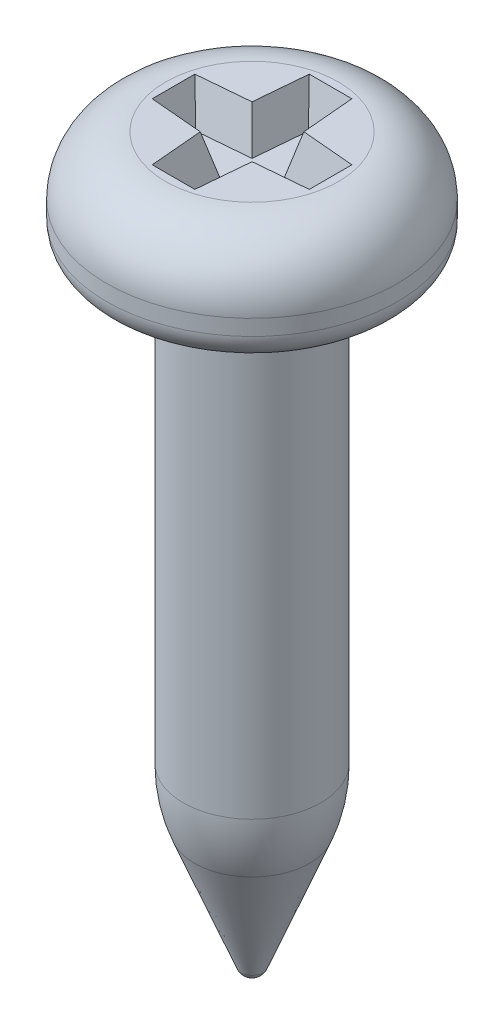
ISO-10303-21;
HEADER;
FILE_DESCRIPTION(('STEP AP214'),'2;1');
FILE_NAME('part.step','',(''),(''),'','','');
FILE_SCHEMA(('AUTOMOTIVE_DESIGN { 1 0 10303 214 1 1 1 1 }'));
ENDSEC;
DATA;
#1=APPLICATION_CONTEXT('core data for automotive mechanical design processes');
#2=APPLICATION_PROTOCOL_DEFINITION('international standard','automotive_design',2000,#1);
#3=PRODUCT_CONTEXT('',#1,'mechanical');
#4=PRODUCT('Part','Part','',(#3));
#5=PRODUCT_RELATED_PRODUCT_CATEGORY('part','',(#4));
#6=PRODUCT_DEFINITION_FORMATION('','',#4);
#7=PRODUCT_DEFINITION_CONTEXT('part definition',#1,'design');
#8=PRODUCT_DEFINITION('design','',#6,#7);
#9=PRODUCT_DEFINITION_SHAPE('','',#8);
#10=(LENGTH_UNIT() NAMED_UNIT(*) SI_UNIT(.MILLI.,.METRE.));
#11=(NAMED_UNIT(*) PLANE_ANGLE_UNIT() SI_UNIT($,.RADIAN.));
#12=(NAMED_UNIT(*) SI_UNIT($,.STERADIAN.) SOLID_ANGLE_UNIT());
#13=UNCERTAINTY_MEASURE_WITH_UNIT(LENGTH_MEASURE(1.E-05),#10,'distance_accuracy_value','');
#14=(GEOMETRIC_REPRESENTATION_CONTEXT(3) GLOBAL_UNCERTAINTY_ASSIGNED_CONTEXT((#13)) GLOBAL_UNIT_ASSIGNED_CONTEXT((#10,
#11,#12)) REPRESENTATION_CONTEXT('',''));
#15=CARTESIAN_POINT('',(0.,0.,0.));
#16=DIRECTION('',(0.,0.,1.));
#17=DIRECTION('',(1.,0.,0.));
#18=AXIS2_PLACEMENT_3D('',#15,#16,#17);
#19=CARTESIAN_POINT('',(1.1,0.,0.));
#20=DIRECTION('',(0.,-1.,0.));
#21=DIRECTION('',(1.,0.,0.));
#22=AXIS2_PLACEMENT_3D('',#19,#20,#21);
#23=PLANE('',#22);
#24=DIRECTION('',(-1.,0.,0.));
#25=VECTOR('',#24,1.);
#26=CARTESIAN_POINT('',(-0.271382595437633,0.,-1.));
#27=LINE('',#26,#25);
#28=CARTESIAN_POINT('',(0.271382595437633,0.,-1.));
#29=VERTEX_POINT('',#28);
#30=CARTESIAN_POINT('',(-0.271382595437633,0.,-1.));
#31=VERTEX_POINT('',#30);
#32=EDGE_CURVE('E140',#29,#31,#27,.T.);
#33=ORIENTED_EDGE('',*,*,#32,.F.);
#34=DIRECTION('',(-0.0871557427476548,0.,-0.996194698091746));
#35=VECTOR('',#34,1.);
#36=CARTESIAN_POINT('',(0.271382595437633,0.,-1.));
#37=LINE('',#36,#35);
#38=CARTESIAN_POINT('',(0.33,0.,-0.33));
#39=VERTEX_POINT('',#38);
#40=EDGE_CURVE('E48',#39,#29,#37,.T.);
#41=ORIENTED_EDGE('',*,*,#40,.F.);
#42=DIRECTION('',(-0.996194698091746,0.,-0.0871557427476548));
#43=VECTOR('',#42,1.);
#44=CARTESIAN_POINT('',(0.33,0.,-0.33));
#45=LINE('',#44,#43);
#46=CARTESIAN_POINT('',(1.,0.,-0.271382595437633));
#47=VERTEX_POINT('',#46);
#48=EDGE_CURVE('E172',#47,#39,#45,.T.);
#49=ORIENTED_EDGE('',*,*,#48,.F.);
#50=DIRECTION('',(0.,0.,-1.));
#51=VECTOR('',#50,1.);
#52=CARTESIAN_POINT('',(1.,0.,-0.271382595437633));
#53=LINE('',#52,#51);
#54=CARTESIAN_POINT('',(1.,0.,0.271382595437633));
#55=VERTEX_POINT('',#54);
#56=EDGE_CURVE('E170',#55,#47,#53,.T.);
#57=ORIENTED_EDGE('',*,*,#56,.F.);
#58=DIRECTION('',(0.996194698091746,0.,-0.0871557427476548));
#59=VECTOR('',#58,1.);
#60=CARTESIAN_POINT('',(0.33,0.,0.33));
#61=LINE('',#60,#59);
#62=CARTESIAN_POINT('',(0.33,0.,0.33));
#63=VERTEX_POINT('',#62);
#64=EDGE_CURVE('E167',#63,#55,#61,.T.);
#65=ORIENTED_EDGE('',*,*,#64,.F.);
#66=DIRECTION('',(0.0871557427476548,0.,-0.996194698091746));
#67=VECTOR('',#66,1.);
#68=CARTESIAN_POINT('',(0.271382595437633,0.,1.));
#69=LINE('',#68,#67);
#70=CARTESIAN_POINT('',(0.271382595437633,0.,1.));
#71=VERTEX_POINT('',#70);
#72=EDGE_CURVE('E164',#71,#63,#69,.T.);
#73=ORIENTED_EDGE('',*,*,#72,.F.);
#74=DIRECTION('',(1.,0.,0.));
#75=VECTOR('',#74,1.);
#76=CARTESIAN_POINT('',(-0.271382595437633,0.,1.));
#77=LINE('',#76,#75);
#78=CARTESIAN_POINT('',(-0.271382595437633,0.,1.));
#79=VERTEX_POINT('',#78);
#80=EDGE_CURVE('E161',#79,#71,#77,.T.);
#81=ORIENTED_EDGE('',*,*,#80,.F.);
#82=DIRECTION('',(0.0871557427476548,0.,0.996194698091746));
#83=VECTOR('',#82,1.);
#84=CARTESIAN_POINT('',(-0.271382595437633,0.,1.));
#85=LINE('',#84,#83);
#86=CARTESIAN_POINT('',(-0.33,0.,0.33));
#87=VERTEX_POINT('',#86);
#88=EDGE_CURVE('E158',#87,#79,#85,.T.);
#89=ORIENTED_EDGE('',*,*,#88,.F.);
#90=DIRECTION('',(0.996194698091746,0.,0.0871557427476548));
#91=VECTOR('',#90,1.);
#92=CARTESIAN_POINT('',(-0.33,0.,0.33));
#93=LINE('',#92,#91);
#94=CARTESIAN_POINT('',(-1.,0.,0.271382595437633));
#95=VERTEX_POINT('',#94);
#96=EDGE_CURVE('E155',#95,#87,#93,.T.);
#97=ORIENTED_EDGE('',*,*,#96,.F.);
#98=DIRECTION('',(0.,0.,1.));
#99=VECTOR('',#98,1.);
#100=CARTESIAN_POINT('',(-1.,0.,-0.271382595437633));
#101=LINE('',#100,#99);
#102=CARTESIAN_POINT('',(-1.,0.,-0.271382595437633));
#103=VERTEX_POINT('',#102);
#104=EDGE_CURVE('E149',#103,#95,#101,.T.);
#105=ORIENTED_EDGE('',*,*,#104,.F.);
#106=DIRECTION('',(-0.996194698091746,0.,0.0871557427476548));
#107=VECTOR('',#106,1.);
#108=CARTESIAN_POINT('',(-0.33,0.,-0.33));
#109=LINE('',#108,#107);
#110=CARTESIAN_POINT('',(-0.33,0.,-0.33));
#111=VERTEX_POINT('',#110);
#112=EDGE_CURVE('E147',#111,#103,#109,.T.);
#113=ORIENTED_EDGE('',*,*,#112,.F.);
#114=DIRECTION('',(-0.0871557427476548,0.,0.996194698091746));
#115=VECTOR('',#114,1.);
#116=CARTESIAN_POINT('',(-0.271382595437633,0.,-1.));
#117=LINE('',#116,#115);
#118=EDGE_CURVE('E131',#31,#111,#117,.T.);
#119=ORIENTED_EDGE('',*,*,#118,.F.);
#120=EDGE_LOOP('',(#33,#41,#49,#57,#65,#73,#81,#89,#97,#105,#113,#119));
#121=FACE_BOUND('',#120,.T.);
#122=CARTESIAN_POINT('',(0.,0.,0.));
#123=DIRECTION('',(0.,1.,0.));
#124=DIRECTION('',(-1.,0.,0.));
#125=AXIS2_PLACEMENT_3D('',#122,#123,#124);
#126=CIRCLE('',#125,1.1);
#127=CARTESIAN_POINT('',(-1.1,0.,0.));
#128=VERTEX_POINT('',#127);
#129=EDGE_CURVE('E11',#128,#128,#126,.T.);
#130=ORIENTED_EDGE('',*,*,#129,.T.);
#131=EDGE_LOOP('',(#130));
#132=FACE_BOUND('',#131,.T.);
#133=ADVANCED_FACE('F34',(#121,#132),#23,.F.);
#134=CARTESIAN_POINT('',(0.,-0.75,0.));
#135=DIRECTION('',(0.,1.,0.));
#136=DIRECTION('',(-1.,0.,0.));
#137=AXIS2_PLACEMENT_3D('',#134,#135,#136);
#138=TOROIDAL_SURFACE('',#137,1.1,0.75);
#139=ORIENTED_EDGE('',*,*,#129,.F.);
#140=EDGE_LOOP('',(#139));
#141=FACE_BOUND('',#140,.T.);
#142=CARTESIAN_POINT('',(0.,-0.75,0.));
#143=DIRECTION('',(0.,1.,0.));
#144=DIRECTION('',(-1.,0.,0.));
#145=AXIS2_PLACEMENT_3D('',#142,#143,#144);
#146=CIRCLE('',#145,1.85);
#147=CARTESIAN_POINT('',(-1.85,-0.75,0.));
#148=VERTEX_POINT('',#147);
#149=EDGE_CURVE('E41',#148,#148,#146,.T.);
#150=ORIENTED_EDGE('',*,*,#149,.T.);
#151=EDGE_LOOP('',(#150));
#152=FACE_BOUND('',#151,.T.);
#153=ADVANCED_FACE('F248',(#141,#152),#138,.T.);
#154=CARTESIAN_POINT('',(0.,0.,0.));
#155=DIRECTION('',(0.,1.,0.));
#156=DIRECTION('',(-1.,0.,0.));
#157=AXIS2_PLACEMENT_3D('',#154,#155,#156);
#158=CYLINDRICAL_SURFACE('',#157,1.85);
#159=ORIENTED_EDGE('',*,*,#149,.F.);
#160=EDGE_LOOP('',(#159));
#161=FACE_BOUND('',#160,.T.);
#162=CARTESIAN_POINT('',(0.,-0.95,0.));
#163=DIRECTION('',(0.,1.,0.));
#164=DIRECTION('',(-1.,0.,0.));
#165=AXIS2_PLACEMENT_3D('',#162,#163,#164);
#166=CIRCLE('',#165,1.85);
#167=CARTESIAN_POINT('',(-1.85,-0.95,0.));
#168=VERTEX_POINT('',#167);
#169=EDGE_CURVE('E243',#168,#168,#166,.T.);
#170=ORIENTED_EDGE('',*,*,#169,.T.);
#171=EDGE_LOOP('',(#170));
#172=FACE_BOUND('',#171,.T.);
#173=ADVANCED_FACE('F250',(#161,#172),#158,.T.);
#174=CARTESIAN_POINT('',(0.,-0.95,0.));
#175=DIRECTION('',(0.,1.,0.));
#176=DIRECTION('',(-1.,0.,0.));
#177=AXIS2_PLACEMENT_3D('',#174,#175,#176);
#178=TOROIDAL_SURFACE('',#177,1.5,0.35);
#179=ORIENTED_EDGE('',*,*,#169,.F.);
#180=EDGE_LOOP('',(#179));
#181=FACE_BOUND('',#180,.T.);
#182=CARTESIAN_POINT('',(0.,-1.3,0.));
#183=DIRECTION('',(0.,1.,0.));
#184=DIRECTION('',(-1.,0.,0.));
#185=AXIS2_PLACEMENT_3D('',#182,#183,#184);
#186=CIRCLE('',#185,1.5);
#187=CARTESIAN_POINT('',(-1.5,-1.3,0.));
#188=VERTEX_POINT('',#187);
#189=EDGE_CURVE('E240',#188,#188,#186,.T.);
#190=ORIENTED_EDGE('',*,*,#189,.T.);
#191=EDGE_LOOP('',(#190));
#192=FACE_BOUND('',#191,.T.);
#193=ADVANCED_FACE('F253',(#181,#192),#178,.T.);
#194=CARTESIAN_POINT('',(1.025,-1.3,0.));
#195=DIRECTION('',(0.,1.,0.));
#196=DIRECTION('',(-1.,0.,0.));
#197=AXIS2_PLACEMENT_3D('',#194,#195,#196);
#198=PLANE('',#197);
#199=ORIENTED_EDGE('',*,*,#189,.F.);
#200=EDGE_LOOP('',(#199));
#201=FACE_BOUND('',#200,.T.);
#202=CARTESIAN_POINT('',(0.,-1.3,0.));
#203=DIRECTION('',(0.,1.,0.));
#204=DIRECTION('',(-1.,0.,0.));
#205=AXIS2_PLACEMENT_3D('',#202,#203,#204);
#206=CIRCLE('',#205,1.025);
#207=CARTESIAN_POINT('',(-1.025,-1.3,0.));
#208=VERTEX_POINT('',#207);
#209=EDGE_CURVE('E237',#208,#208,#206,.T.);
#210=ORIENTED_EDGE('',*,*,#209,.T.);
#211=EDGE_LOOP('',(#210));
#212=FACE_BOUND('',#211,.T.);
#213=ADVANCED_FACE('F259',(#201,#212),#198,.F.);
#214=CARTESIAN_POINT('',(0.,-1.45,0.));
#215=DIRECTION('',(0.,1.,0.));
#216=DIRECTION('',(-1.,0.,0.));
#217=AXIS2_PLACEMENT_3D('',#214,#215,#216);
#218=TOROIDAL_SURFACE('',#217,1.025,0.15);
#219=ORIENTED_EDGE('',*,*,#209,.F.);
#220=EDGE_LOOP('',(#219));
#221=FACE_BOUND('',#220,.T.);
#222=CARTESIAN_POINT('',(0.,-1.45,0.));
#223=DIRECTION('',(0.,1.,0.));
#224=DIRECTION('',(-1.,0.,0.));
#225=AXIS2_PLACEMENT_3D('',#222,#223,#224);
#226=CIRCLE('',#225,0.874999999999999);
#227=CARTESIAN_POINT('',(-0.874999999999999,-1.45,0.));
#228=VERTEX_POINT('',#227);
#229=EDGE_CURVE('E234',#228,#228,#226,.T.);
#230=ORIENTED_EDGE('',*,*,#229,.T.);
#231=EDGE_LOOP('',(#230));
#232=FACE_BOUND('',#231,.T.);
#233=ADVANCED_FACE('F265',(#221,#232),#218,.F.);
#234=CARTESIAN_POINT('',(0.,0.,0.));
#235=DIRECTION('',(0.,1.,0.));
#236=DIRECTION('',(-1.,0.,0.));
#237=AXIS2_PLACEMENT_3D('',#234,#235,#236);
#238=CYLINDRICAL_SURFACE('',#237,0.875);
#239=ORIENTED_EDGE('',*,*,#229,.F.);
#240=EDGE_LOOP('',(#239));
#241=FACE_BOUND('',#240,.T.);
#242=CARTESIAN_POINT('',(0.,-6.96440542344636,0.));
#243=DIRECTION('',(0.,1.,0.));
#244=DIRECTION('',(-1.,0.,0.));
#245=AXIS2_PLACEMENT_3D('',#242,#243,#244);
#246=CIRCLE('',#245,0.875);
#247=CARTESIAN_POINT('',(-0.874999999999999,-6.96440542344636,0.));
#248=VERTEX_POINT('',#247);
#249=EDGE_CURVE('E231',#248,#248,#246,.T.);
#250=ORIENTED_EDGE('',*,*,#249,.T.);
#251=EDGE_LOOP('',(#250));
#252=FACE_BOUND('',#251,.T.);
#253=ADVANCED_FACE('F271',(#241,#252),#238,.T.);
#254=CARTESIAN_POINT('',(0.,-6.96440542344636,0.));
#255=DIRECTION('',(0.,1.,0.));
#256=DIRECTION('',(-1.,0.,0.));
#257=AXIS2_PLACEMENT_3D('',#254,#255,#256);
#258=DEGENERATE_TOROIDAL_SURFACE('',#257,1.125,2.,.F.);
#259=ORIENTED_EDGE('',*,*,#249,.F.);
#260=EDGE_LOOP('',(#259));
#261=FACE_BOUND('',#260,.T.);
#262=CARTESIAN_POINT('',(0.,-7.7,0.));
#263=DIRECTION('',(0.,1.,0.));
#264=DIRECTION('',(-1.,0.,0.));
#265=AXIS2_PLACEMENT_3D('',#262,#263,#264);
#266=CIRCLE('',#265,0.73481198483741);
#267=CARTESIAN_POINT('',(-0.734811984837409,-7.7,0.));
#268=VERTEX_POINT('',#267);
#269=EDGE_CURVE('E228',#268,#268,#266,.T.);
#270=ORIENTED_EDGE('',*,*,#269,.T.);
#271=EDGE_LOOP('',(#270));
#272=FACE_BOUND('',#271,.T.);
#273=ADVANCED_FACE('F277',(#261,#272),#258,.F.);
#274=CARTESIAN_POINT('',(0.,-9.20516959324152,0.));
#275=DIRECTION('',(0.,1.,0.));
#276=DIRECTION('',(-1.,0.,0.));
#277=AXIS2_PLACEMENT_3D('',#274,#275,#276);
#278=CONICAL_SURFACE('',#277,0.139485898862806,0.376639161138822);
#279=ORIENTED_EDGE('',*,*,#269,.F.);
#280=EDGE_LOOP('',(#279));
#281=FACE_BOUND('',#280,.T.);
#282=CARTESIAN_POINT('',(0.,-9.20516959324152,0.));
#283=DIRECTION('',(0.,1.,0.));
#284=DIRECTION('',(-1.,0.,0.));
#285=AXIS2_PLACEMENT_3D('',#282,#283,#284);
#286=CIRCLE('',#285,0.139485898862806);
#287=CARTESIAN_POINT('',(-0.139485898862805,-9.20516959324152,0.));
#288=VERTEX_POINT('',#287);
#289=EDGE_CURVE('E176',#288,#288,#286,.T.);
#290=ORIENTED_EDGE('',*,*,#289,.T.);
#291=EDGE_LOOP('',(#290));
#292=FACE_BOUND('',#291,.T.);
#293=ADVANCED_FACE('F283',(#281,#292),#278,.T.);
#294=CARTESIAN_POINT('',(0.,-9.15,0.));
#295=DIRECTION('',(0.,1.,0.));
#296=DIRECTION('',(-1.,0.,0.));
#297=AXIS2_PLACEMENT_3D('',#294,#295,#296);
#298=SPHERICAL_SURFACE('',#297,0.149999999999999);
#299=ORIENTED_EDGE('',*,*,#289,.F.);
#300=EDGE_LOOP('',(#299));
#301=FACE_BOUND('',#300,.T.);
#302=ADVANCED_FACE('F289',(#301),#298,.T.);
#303=CARTESIAN_POINT('',(0.271382595437633,0.,-1.));
#304=DIRECTION('',(0.962250186899058,-0.258819045102521,-0.0841859828293659));
#305=DIRECTION('',(0.259741110692871,0.965678287741851,0.));
#306=AXIS2_PLACEMENT_3D('',#303,#304,#305);
#307=PLANE('',#306);
#308=ORIENTED_EDGE('',*,*,#40,.T.);
#309=DIRECTION('',(0.230762906723662,0.939855498552101,-0.251833521838986));
#310=VECTOR('',#309,1.);
#311=CARTESIAN_POINT('',(0.271382595437633,0.,-1.));
#312=LINE('',#311,#310);
#313=CARTESIAN_POINT('',(0.148617496398917,-0.5,-0.866025403784438));
#314=VERTEX_POINT('',#313);
#315=EDGE_CURVE('E91',#314,#29,#312,.T.);
#316=ORIENTED_EDGE('',*,*,#315,.F.);
#317=DIRECTION('',(-0.0871557427476548,0.,-0.996194698091746));
#318=VECTOR('',#317,1.);
#319=CARTESIAN_POINT('',(0.222680446133132,-0.5,-0.0194820146255435));
#320=LINE('',#319,#318);
#321=CARTESIAN_POINT('',(0.206333094846248,-0.5,-0.206333094846248));
#322=VERTEX_POINT('',#321);
#323=EDGE_CURVE('E174',#322,#314,#320,.T.);
#324=ORIENTED_EDGE('',*,*,#323,.F.);
#325=DIRECTION('',(0.233463888260859,0.943922256203466,-0.233463888260859));
#326=VECTOR('',#325,1.);
#327=CARTESIAN_POINT('',(0.363323645043907,0.134731458681192,-0.363323645043907));
#328=LINE('',#327,#326);
#329=EDGE_CURVE('E56',#322,#39,#328,.T.);
#330=ORIENTED_EDGE('',*,*,#329,.T.);
#331=EDGE_LOOP('',(#308,#316,#324,#330));
#332=FACE_BOUND('',#331,.T.);
#333=ADVANCED_FACE('F294',(#332),#307,.F.);
#334=CARTESIAN_POINT('',(0.33,0.,-0.33));
#335=DIRECTION('',(0.0841859828293659,-0.258819045102521,-0.962250186899058));
#336=DIRECTION('',(0.,0.965678287741851,-0.259741110692871));
#337=AXIS2_PLACEMENT_3D('',#334,#335,#336);
#338=PLANE('',#337);
#339=ORIENTED_EDGE('',*,*,#48,.T.);
#340=ORIENTED_EDGE('',*,*,#329,.F.);
#341=DIRECTION('',(-0.996194698091746,0.,-0.0871557427476548));
#342=VECTOR('',#341,1.);
#343=CARTESIAN_POINT('',(0.0194820146255435,-0.5,-0.222680446133132));
#344=LINE('',#343,#342);
#345=CARTESIAN_POINT('',(0.866025403784438,-0.5,-0.148617496398917));
#346=VERTEX_POINT('',#345);
#347=EDGE_CURVE('E177',#346,#322,#344,.T.);
#348=ORIENTED_EDGE('',*,*,#347,.F.);
#349=DIRECTION('',(0.251833521838986,0.939855498552101,-0.230762906723662));
#350=VECTOR('',#349,1.);
#351=CARTESIAN_POINT('',(1.,0.,-0.271382595437633));
#352=LINE('',#351,#350);
#353=EDGE_CURVE('E96',#346,#47,#352,.T.);
#354=ORIENTED_EDGE('',*,*,#353,.T.);
#355=EDGE_LOOP('',(#339,#340,#348,#354));
#356=FACE_BOUND('',#355,.T.);
#357=ADVANCED_FACE('F299',(#356),#338,.F.);
#358=CARTESIAN_POINT('',(1.,0.,-0.271382595437633));
#359=DIRECTION('',(0.965925826289068,-0.258819045102521,0.));
#360=DIRECTION('',(0.258819045102521,0.965925826289068,0.));
#361=AXIS2_PLACEMENT_3D('',#358,#359,#360);
#362=PLANE('',#361);
#363=ORIENTED_EDGE('',*,*,#56,.T.);
#364=ORIENTED_EDGE('',*,*,#353,.F.);
#365=DIRECTION('',(0.,0.,-1.));
#366=VECTOR('',#365,1.);
#367=CARTESIAN_POINT('',(0.866025403784438,-0.5,0.));
#368=LINE('',#367,#366);
#369=CARTESIAN_POINT('',(0.866025403784438,-0.5,0.148617496398917));
#370=VERTEX_POINT('',#369);
#371=EDGE_CURVE('E200',#370,#346,#368,.T.);
#372=ORIENTED_EDGE('',*,*,#371,.F.);
#373=DIRECTION('',(0.251833521838986,0.939855498552101,0.230762906723662));
#374=VECTOR('',#373,1.);
#375=CARTESIAN_POINT('',(0.960914999983138,-0.145867205876761,0.23556779148571));
#376=LINE('',#375,#374);
#377=EDGE_CURVE('E192',#370,#55,#376,.T.);
#378=ORIENTED_EDGE('',*,*,#377,.T.);
#379=EDGE_LOOP('',(#363,#364,#372,#378));
#380=FACE_BOUND('',#379,.T.);
#381=ADVANCED_FACE('F361',(#380),#362,.F.);
#382=CARTESIAN_POINT('',(0.33,0.,0.33));
#383=DIRECTION('',(0.0841859828293659,-0.258819045102521,0.962250186899058));
#384=DIRECTION('',(0.,-0.965678287741851,-0.259741110692871));
#385=AXIS2_PLACEMENT_3D('',#382,#383,#384);
#386=PLANE('',#385);
#387=ORIENTED_EDGE('',*,*,#64,.T.);
#388=ORIENTED_EDGE('',*,*,#377,.F.);
#389=DIRECTION('',(0.996194698091746,0.,-0.0871557427476548));
#390=VECTOR('',#389,1.);
#391=CARTESIAN_POINT('',(0.0194820146255435,-0.5,0.222680446133132));
#392=LINE('',#391,#390);
#393=CARTESIAN_POINT('',(0.206333094846248,-0.5,0.206333094846248));
#394=VERTEX_POINT('',#393);
#395=EDGE_CURVE('E203',#394,#370,#392,.T.);
#396=ORIENTED_EDGE('',*,*,#395,.F.);
#397=DIRECTION('',(0.233463888260859,0.943922256203466,0.233463888260859));
#398=VECTOR('',#397,1.);
#399=CARTESIAN_POINT('',(0.33,0.,0.33));
#400=LINE('',#399,#398);
#401=EDGE_CURVE('E190',#394,#63,#400,.T.);
#402=ORIENTED_EDGE('',*,*,#401,.T.);
#403=EDGE_LOOP('',(#387,#388,#396,#402));
#404=FACE_BOUND('',#403,.T.);
#405=ADVANCED_FACE('F369',(#404),#386,.F.);
#406=CARTESIAN_POINT('',(0.271382595437633,0.,1.));
#407=DIRECTION('',(0.962250186899058,-0.258819045102521,0.0841859828293659));
#408=DIRECTION('',(0.259741110692871,0.965678287741851,0.));
#409=AXIS2_PLACEMENT_3D('',#406,#407,#408);
#410=PLANE('',#409);
#411=ORIENTED_EDGE('',*,*,#72,.T.);
#412=ORIENTED_EDGE('',*,*,#401,.F.);
#413=DIRECTION('',(0.0871557427476548,0.,-0.996194698091746));
#414=VECTOR('',#413,1.);
#415=CARTESIAN_POINT('',(0.222680446133132,-0.5,0.0194820146255435));
#416=LINE('',#415,#414);
#417=CARTESIAN_POINT('',(0.148617496398917,-0.5,0.866025403784438));
#418=VERTEX_POINT('',#417);
#419=EDGE_CURVE('E206',#418,#394,#416,.T.);
#420=ORIENTED_EDGE('',*,*,#419,.F.);
#421=DIRECTION('',(0.230762906723662,0.939855498552101,0.251833521838986));
#422=VECTOR('',#421,1.);
#423=CARTESIAN_POINT('',(0.242479524498311,-0.117716969910997,0.968457832976909));
#424=LINE('',#423,#422);
#425=EDGE_CURVE('E188',#418,#71,#424,.T.);
#426=ORIENTED_EDGE('',*,*,#425,.T.);
#427=EDGE_LOOP('',(#411,#412,#420,#426));
#428=FACE_BOUND('',#427,.T.);
#429=ADVANCED_FACE('F379',(#428),#410,.F.);
#430=CARTESIAN_POINT('',(-0.271382595437633,0.,1.));
#431=DIRECTION('',(0.,-0.258819045102521,0.965925826289068));
#432=DIRECTION('',(0.,-0.965925826289068,-0.258819045102521));
#433=AXIS2_PLACEMENT_3D('',#430,#431,#432);
#434=PLANE('',#433);
#435=ORIENTED_EDGE('',*,*,#80,.T.);
#436=ORIENTED_EDGE('',*,*,#425,.F.);
#437=DIRECTION('',(1.,0.,0.));
#438=VECTOR('',#437,1.);
#439=CARTESIAN_POINT('',(0.,-0.5,0.866025403784438));
#440=LINE('',#439,#438);
#441=CARTESIAN_POINT('',(-0.148617496398917,-0.5,0.866025403784438));
#442=VERTEX_POINT('',#441);
#443=EDGE_CURVE('E209',#442,#418,#440,.T.);
#444=ORIENTED_EDGE('',*,*,#443,.F.);
#445=DIRECTION('',(-0.230762906723662,0.939855498552101,0.251833521838986));
#446=VECTOR('',#445,1.);
#447=CARTESIAN_POINT('',(-0.271382595437633,0.,1.));
#448=LINE('',#447,#446);
#449=EDGE_CURVE('E186',#442,#79,#448,.T.);
#450=ORIENTED_EDGE('',*,*,#449,.T.);
#451=EDGE_LOOP('',(#435,#436,#444,#450));
#452=FACE_BOUND('',#451,.T.);
#453=ADVANCED_FACE('F389',(#452),#434,.F.);
#454=CARTESIAN_POINT('',(-0.271382595437633,0.,1.));
#455=DIRECTION('',(-0.962250186899058,-0.258819045102521,0.0841859828293659));
#456=DIRECTION('',(0.259741110692871,-0.965678287741851,0.));
#457=AXIS2_PLACEMENT_3D('',#454,#455,#456);
#458=PLANE('',#457);
#459=ORIENTED_EDGE('',*,*,#88,.T.);
#460=ORIENTED_EDGE('',*,*,#449,.F.);
#461=DIRECTION('',(0.0871557427476548,0.,0.996194698091746));
#462=VECTOR('',#461,1.);
#463=CARTESIAN_POINT('',(-0.222680446133132,-0.5,0.0194820146255435));
#464=LINE('',#463,#462);
#465=CARTESIAN_POINT('',(-0.206333094846248,-0.5,0.206333094846248));
#466=VERTEX_POINT('',#465);
#467=EDGE_CURVE('E212',#466,#442,#464,.T.);
#468=ORIENTED_EDGE('',*,*,#467,.F.);
#469=DIRECTION('',(-0.23346388826086,0.943922256203466,0.233463888260859));
#470=VECTOR('',#469,1.);
#471=CARTESIAN_POINT('',(-0.363323645043907,0.134731458681192,0.363323645043907));
#472=LINE('',#471,#470);
#473=EDGE_CURVE('E184',#466,#87,#472,.T.);
#474=ORIENTED_EDGE('',*,*,#473,.T.);
#475=EDGE_LOOP('',(#459,#460,#468,#474));
#476=FACE_BOUND('',#475,.T.);
#477=ADVANCED_FACE('F399',(#476),#458,.F.);
#478=CARTESIAN_POINT('',(-0.33,0.,0.33));
#479=DIRECTION('',(-0.0841859828293659,-0.258819045102521,0.962250186899058));
#480=DIRECTION('',(0.,-0.965678287741851,-0.259741110692871));
#481=AXIS2_PLACEMENT_3D('',#478,#479,#480);
#482=PLANE('',#481);
#483=ORIENTED_EDGE('',*,*,#96,.T.);
#484=ORIENTED_EDGE('',*,*,#473,.F.);
#485=DIRECTION('',(0.996194698091746,0.,0.0871557427476548));
#486=VECTOR('',#485,1.);
#487=CARTESIAN_POINT('',(-0.0194820146255434,-0.5,0.222680446133132));
#488=LINE('',#487,#486);
#489=CARTESIAN_POINT('',(-0.866025403784438,-0.5,0.148617496398917));
#490=VERTEX_POINT('',#489);
#491=EDGE_CURVE('E215',#490,#466,#488,.T.);
#492=ORIENTED_EDGE('',*,*,#491,.F.);
#493=DIRECTION('',(-0.251833521838987,0.939855498552101,0.230762906723662));
#494=VECTOR('',#493,1.);
#495=CARTESIAN_POINT('',(-0.968457832976909,-0.117716969910997,0.242479524498311));
#496=LINE('',#495,#494);
#497=EDGE_CURVE('E182',#490,#95,#496,.T.);
#498=ORIENTED_EDGE('',*,*,#497,.T.);
#499=EDGE_LOOP('',(#483,#484,#492,#498));
#500=FACE_BOUND('',#499,.T.);
#501=ADVANCED_FACE('F409',(#500),#482,.F.);
#502=CARTESIAN_POINT('',(-1.,0.,-0.271382595437633));
#503=DIRECTION('',(-0.965925826289068,-0.258819045102521,0.));
#504=DIRECTION('',(0.258819045102522,-0.965925826289068,0.));
#505=AXIS2_PLACEMENT_3D('',#502,#503,#504);
#506=PLANE('',#505);
#507=ORIENTED_EDGE('',*,*,#104,.T.);
#508=ORIENTED_EDGE('',*,*,#497,.F.);
#509=DIRECTION('',(0.,0.,1.));
#510=VECTOR('',#509,1.);
#511=CARTESIAN_POINT('',(-0.866025403784438,-0.5,0.));
#512=LINE('',#511,#510);
#513=CARTESIAN_POINT('',(-0.866025403784438,-0.5,-0.148617496398917));
#514=VERTEX_POINT('',#513);
#515=EDGE_CURVE('E218',#514,#490,#512,.T.);
#516=ORIENTED_EDGE('',*,*,#515,.F.);
#517=DIRECTION('',(-0.251833521838987,0.939855498552101,-0.230762906723662));
#518=VECTOR('',#517,1.);
#519=CARTESIAN_POINT('',(-0.960914999983137,-0.145867205876761,-0.23556779148571));
#520=LINE('',#519,#518);
#521=EDGE_CURVE('E180',#514,#103,#520,.T.);
#522=ORIENTED_EDGE('',*,*,#521,.T.);
#523=EDGE_LOOP('',(#507,#508,#516,#522));
#524=FACE_BOUND('',#523,.T.);
#525=ADVANCED_FACE('F419',(#524),#506,.F.);
#526=CARTESIAN_POINT('',(-0.33,0.,-0.33));
#527=DIRECTION('',(-0.0841859828293659,-0.258819045102521,-0.962250186899058));
#528=DIRECTION('',(0.,0.965678287741851,-0.259741110692871));
#529=AXIS2_PLACEMENT_3D('',#526,#527,#528);
#530=PLANE('',#529);
#531=ORIENTED_EDGE('',*,*,#112,.T.);
#532=ORIENTED_EDGE('',*,*,#521,.F.);
#533=DIRECTION('',(-0.996194698091746,0.,0.0871557427476548));
#534=VECTOR('',#533,1.);
#535=CARTESIAN_POINT('',(-0.0194820146255434,-0.5,-0.222680446133132));
#536=LINE('',#535,#534);
#537=CARTESIAN_POINT('',(-0.206333094846248,-0.5,-0.206333094846248));
#538=VERTEX_POINT('',#537);
#539=EDGE_CURVE('E221',#538,#514,#536,.T.);
#540=ORIENTED_EDGE('',*,*,#539,.F.);
#541=DIRECTION('',(-0.23346388826086,0.943922256203466,-0.233463888260859));
#542=VECTOR('',#541,1.);
#543=CARTESIAN_POINT('',(-0.33,0.,-0.33));
#544=LINE('',#543,#542);
#545=EDGE_CURVE('E137',#538,#111,#544,.T.);
#546=ORIENTED_EDGE('',*,*,#545,.T.);
#547=EDGE_LOOP('',(#531,#532,#540,#546));
#548=FACE_BOUND('',#547,.T.);
#549=ADVANCED_FACE('F429',(#548),#530,.F.);
#550=CARTESIAN_POINT('',(-0.271382595437633,0.,-1.));
#551=DIRECTION('',(-0.962250186899058,-0.258819045102521,-0.0841859828293659));
#552=DIRECTION('',(0.259741110692871,-0.965678287741851,0.));
#553=AXIS2_PLACEMENT_3D('',#550,#551,#552);
#554=PLANE('',#553);
#555=ORIENTED_EDGE('',*,*,#118,.T.);
#556=ORIENTED_EDGE('',*,*,#545,.F.);
#557=DIRECTION('',(-0.0871557427476548,0.,0.996194698091746));
#558=VECTOR('',#557,1.);
#559=CARTESIAN_POINT('',(-0.222680446133132,-0.5,-0.0194820146255435));
#560=LINE('',#559,#558);
#561=CARTESIAN_POINT('',(-0.148617496398917,-0.5,-0.866025403784438));
#562=VERTEX_POINT('',#561);
#563=EDGE_CURVE('E134',#562,#538,#560,.T.);
#564=ORIENTED_EDGE('',*,*,#563,.F.);
#565=DIRECTION('',(-0.230762906723662,0.939855498552101,-0.251833521838986));
#566=VECTOR('',#565,1.);
#567=CARTESIAN_POINT('',(-0.271382595437633,0.,-1.));
#568=LINE('',#567,#566);
#569=EDGE_CURVE('E127',#562,#31,#568,.T.);
#570=ORIENTED_EDGE('',*,*,#569,.T.);
#571=EDGE_LOOP('',(#555,#556,#564,#570));
#572=FACE_BOUND('',#571,.T.);
#573=ADVANCED_FACE('F129',(#572),#554,.F.);
#574=CARTESIAN_POINT('',(-0.271382595437633,0.,-1.));
#575=DIRECTION('',(0.,-0.258819045102521,-0.965925826289068));
#576=DIRECTION('',(0.,0.965925826289068,-0.258819045102521));
#577=AXIS2_PLACEMENT_3D('',#574,#575,#576);
#578=PLANE('',#577);
#579=ORIENTED_EDGE('',*,*,#32,.T.);
#580=ORIENTED_EDGE('',*,*,#569,.F.);
#581=DIRECTION('',(-1.,0.,0.));
#582=VECTOR('',#581,1.);
#583=CARTESIAN_POINT('',(0.,-0.5,-0.866025403784438));
#584=LINE('',#583,#582);
#585=EDGE_CURVE('E197',#314,#562,#584,.T.);
#586=ORIENTED_EDGE('',*,*,#585,.F.);
#587=ORIENTED_EDGE('',*,*,#315,.T.);
#588=EDGE_LOOP('',(#579,#580,#586,#587));
#589=FACE_BOUND('',#588,.T.);
#590=ADVANCED_FACE('F141',(#589),#578,.F.);
#591=CARTESIAN_POINT('',(0.,-0.5,0.));
#592=DIRECTION('',(0.,1.,0.));
#593=DIRECTION('',(-1.,0.,0.));
#594=AXIS2_PLACEMENT_3D('',#591,#592,#593);
#595=PLANE('',#594);
#596=ORIENTED_EDGE('',*,*,#323,.T.);
#597=ORIENTED_EDGE('',*,*,#585,.T.);
#598=ORIENTED_EDGE('',*,*,#563,.T.);
#599=ORIENTED_EDGE('',*,*,#539,.T.);
#600=ORIENTED_EDGE('',*,*,#515,.T.);
#601=ORIENTED_EDGE('',*,*,#491,.T.);
#602=ORIENTED_EDGE('',*,*,#467,.T.);
#603=ORIENTED_EDGE('',*,*,#443,.T.);
#604=ORIENTED_EDGE('',*,*,#419,.T.);
#605=ORIENTED_EDGE('',*,*,#395,.T.);
#606=ORIENTED_EDGE('',*,*,#371,.T.);
#607=ORIENTED_EDGE('',*,*,#347,.T.);
#608=EDGE_LOOP('',(#596,#597,#598,#599,#600,#601,#602,#603,#604,#605,#606,#607));
#609=FACE_BOUND('',#608,.T.);
#610=ADVANCED_FACE('F456',(#609),#595,.T.);
#611=CLOSED_SHELL('',(#133,#153,#173,#193,#213,#233,#253,#273,#293,#302,#333,#357,#381,#405,
#429,#453,#477,#501,#525,#549,#573,#590,#610));
#612=MANIFOLD_SOLID_BREP('B2',#611);
#613=ADVANCED_BREP_SHAPE_REPRESENTATION('',(#18,#612),#14);
#614=SHAPE_DEFINITION_REPRESENTATION(#9,#613);
ENDSEC;
END-ISO-10303-21;
